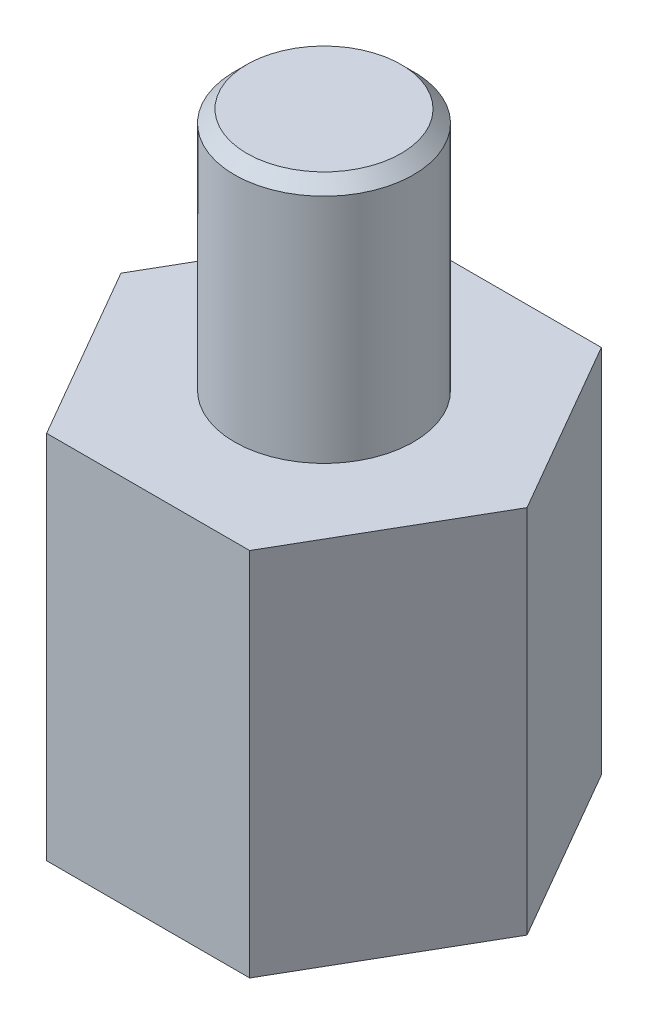
ISO-10303-21;
HEADER;
FILE_DESCRIPTION(('STEP AP214'),'2;1');
FILE_NAME('part.step','',(''),(''),'','','');
FILE_SCHEMA(('AUTOMOTIVE_DESIGN { 1 0 10303 214 1 1 1 1 }'));
ENDSEC;
DATA;
#1=APPLICATION_CONTEXT('core data for automotive mechanical design processes');
#2=APPLICATION_PROTOCOL_DEFINITION('international standard','automotive_design',2000,#1);
#3=PRODUCT_CONTEXT('',#1,'mechanical');
#4=PRODUCT('Part','Part','',(#3));
#5=PRODUCT_RELATED_PRODUCT_CATEGORY('part','',(#4));
#6=PRODUCT_DEFINITION_FORMATION('','',#4);
#7=PRODUCT_DEFINITION_CONTEXT('part definition',#1,'design');
#8=PRODUCT_DEFINITION('design','',#6,#7);
#9=PRODUCT_DEFINITION_SHAPE('','',#8);
#10=(LENGTH_UNIT() NAMED_UNIT(*) SI_UNIT(.MILLI.,.METRE.));
#11=(NAMED_UNIT(*) PLANE_ANGLE_UNIT() SI_UNIT($,.RADIAN.));
#12=(NAMED_UNIT(*) SI_UNIT($,.STERADIAN.) SOLID_ANGLE_UNIT());
#13=UNCERTAINTY_MEASURE_WITH_UNIT(LENGTH_MEASURE(1.E-05),#10,'distance_accuracy_value','');
#14=(GEOMETRIC_REPRESENTATION_CONTEXT(3) GLOBAL_UNCERTAINTY_ASSIGNED_CONTEXT((#13)) GLOBAL_UNIT_ASSIGNED_CONTEXT((#10,
#11,#12)) REPRESENTATION_CONTEXT('',''));
#15=CARTESIAN_POINT('',(0.,0.,0.));
#16=DIRECTION('',(0.,0.,1.));
#17=DIRECTION('',(1.,0.,0.));
#18=AXIS2_PLACEMENT_3D('',#15,#16,#17);
#19=CARTESIAN_POINT('',(0.,0.,0.));
#20=DIRECTION('',(0.,1.,0.));
#21=DIRECTION('',(0.,0.,1.));
#22=AXIS2_PLACEMENT_3D('',#19,#20,#21);
#23=PLANE('',#22);
#24=DIRECTION('',(1.,0.,0.));
#25=VECTOR('',#24,1.);
#26=CARTESIAN_POINT('',(-1.64544826719043,0.,2.85));
#27=LINE('',#26,#25);
#28=CARTESIAN_POINT('',(-1.64544826719043,0.,2.85));
#29=VERTEX_POINT('',#28);
#30=CARTESIAN_POINT('',(1.64544826719043,0.,2.85));
#31=VERTEX_POINT('',#30);
#32=EDGE_CURVE('E128',#29,#31,#27,.T.);
#33=ORIENTED_EDGE('',*,*,#32,.F.);
#34=DIRECTION('',(0.5,0.,0.866025403784438));
#35=VECTOR('',#34,1.);
#36=CARTESIAN_POINT('',(-3.29089653438087,0.,0.));
#37=LINE('',#36,#35);
#38=CARTESIAN_POINT('',(-3.29089653438087,0.,0.));
#39=VERTEX_POINT('',#38);
#40=EDGE_CURVE('E48',#39,#29,#37,.T.);
#41=ORIENTED_EDGE('',*,*,#40,.F.);
#42=DIRECTION('',(-0.5,0.,0.866025403784439));
#43=VECTOR('',#42,1.);
#44=CARTESIAN_POINT('',(-1.64544826719043,0.,-2.85));
#45=LINE('',#44,#43);
#46=CARTESIAN_POINT('',(-1.64544826719043,0.,-2.85));
#47=VERTEX_POINT('',#46);
#48=EDGE_CURVE('E56',#47,#39,#45,.T.);
#49=ORIENTED_EDGE('',*,*,#48,.F.);
#50=DIRECTION('',(-1.,0.,0.));
#51=VECTOR('',#50,1.);
#52=CARTESIAN_POINT('',(1.64544826719043,0.,-2.85));
#53=LINE('',#52,#51);
#54=CARTESIAN_POINT('',(1.64544826719043,0.,-2.85));
#55=VERTEX_POINT('',#54);
#56=EDGE_CURVE('E134',#55,#47,#53,.T.);
#57=ORIENTED_EDGE('',*,*,#56,.F.);
#58=DIRECTION('',(-0.5,0.,-0.866025403784439));
#59=VECTOR('',#58,1.);
#60=CARTESIAN_POINT('',(3.29089653438087,0.,0.));
#61=LINE('',#60,#59);
#62=CARTESIAN_POINT('',(3.29089653438087,0.,0.));
#63=VERTEX_POINT('',#62);
#64=EDGE_CURVE('E132',#63,#55,#61,.T.);
#65=ORIENTED_EDGE('',*,*,#64,.F.);
#66=DIRECTION('',(0.5,0.,-0.866025403784439));
#67=VECTOR('',#66,1.);
#68=CARTESIAN_POINT('',(1.64544826719043,0.,2.85));
#69=LINE('',#68,#67);
#70=EDGE_CURVE('E130',#31,#63,#69,.T.);
#71=ORIENTED_EDGE('',*,*,#70,.F.);
#72=EDGE_LOOP('',(#33,#41,#49,#57,#65,#71));
#73=FACE_BOUND('',#72,.T.);
#74=CARTESIAN_POINT('',(0.,0.,0.));
#75=DIRECTION('',(0.,1.,0.));
#76=DIRECTION('',(0.,0.,1.));
#77=AXIS2_PLACEMENT_3D('',#74,#75,#76);
#78=CIRCLE('',#77,1.4);
#79=CARTESIAN_POINT('',(0.,0.,1.4));
#80=VERTEX_POINT('',#79);
#81=EDGE_CURVE('E125',#80,#80,#78,.T.);
#82=ORIENTED_EDGE('',*,*,#81,.T.);
#83=EDGE_LOOP('',(#82));
#84=FACE_BOUND('',#83,.T.);
#85=ADVANCED_FACE('F33',(#73,#84),#23,.F.);
#86=CARTESIAN_POINT('',(-1.64544826719043,5.,2.85));
#87=DIRECTION('',(0.,0.,-1.));
#88=DIRECTION('',(-1.,0.,0.));
#89=AXIS2_PLACEMENT_3D('',#86,#87,#88);
#90=PLANE('',#89);
#91=ORIENTED_EDGE('',*,*,#32,.T.);
#92=DIRECTION('',(0.,-1.,0.));
#93=VECTOR('',#92,1.);
#94=CARTESIAN_POINT('',(1.64544826719043,5.,2.85));
#95=LINE('',#94,#93);
#96=CARTESIAN_POINT('',(1.64544826719043,6.,2.85));
#97=VERTEX_POINT('',#96);
#98=EDGE_CURVE('E99',#97,#31,#95,.T.);
#99=ORIENTED_EDGE('',*,*,#98,.F.);
#100=DIRECTION('',(1.,0.,0.));
#101=VECTOR('',#100,1.);
#102=CARTESIAN_POINT('',(-1.64544826719043,6.,2.85));
#103=LINE('',#102,#101);
#104=CARTESIAN_POINT('',(-1.64544826719043,6.,2.85));
#105=VERTEX_POINT('',#104);
#106=EDGE_CURVE('E96',#105,#97,#103,.T.);
#107=ORIENTED_EDGE('',*,*,#106,.F.);
#108=DIRECTION('',(0.,-1.,0.));
#109=VECTOR('',#108,1.);
#110=CARTESIAN_POINT('',(-1.64544826719043,5.,2.85));
#111=LINE('',#110,#109);
#112=EDGE_CURVE('E85',#105,#29,#111,.T.);
#113=ORIENTED_EDGE('',*,*,#112,.T.);
#114=EDGE_LOOP('',(#91,#99,#107,#113));
#115=FACE_BOUND('',#114,.T.);
#116=ADVANCED_FACE('F97',(#115),#90,.F.);
#117=CARTESIAN_POINT('',(1.64544826719043,5.,2.85));
#118=DIRECTION('',(-0.866025403784439,0.,-0.5));
#119=DIRECTION('',(-0.5,0.,0.866025403784439));
#120=AXIS2_PLACEMENT_3D('',#117,#118,#119);
#121=PLANE('',#120);
#122=ORIENTED_EDGE('',*,*,#70,.T.);
#123=DIRECTION('',(0.,-1.,0.));
#124=VECTOR('',#123,1.);
#125=CARTESIAN_POINT('',(3.29089653438087,5.,0.));
#126=LINE('',#125,#124);
#127=CARTESIAN_POINT('',(3.29089653438087,6.,0.));
#128=VERTEX_POINT('',#127);
#129=EDGE_CURVE('E144',#128,#63,#126,.T.);
#130=ORIENTED_EDGE('',*,*,#129,.F.);
#131=DIRECTION('',(0.5,0.,-0.866025403784439));
#132=VECTOR('',#131,1.);
#133=CARTESIAN_POINT('',(1.64544826719043,6.,2.85));
#134=LINE('',#133,#132);
#135=EDGE_CURVE('E103',#97,#128,#134,.T.);
#136=ORIENTED_EDGE('',*,*,#135,.F.);
#137=ORIENTED_EDGE('',*,*,#98,.T.);
#138=EDGE_LOOP('',(#122,#130,#136,#137));
#139=FACE_BOUND('',#138,.T.);
#140=ADVANCED_FACE('F166',(#139),#121,.F.);
#141=CARTESIAN_POINT('',(3.29089653438087,5.,0.));
#142=DIRECTION('',(-0.866025403784439,0.,0.5));
#143=DIRECTION('',(0.5,0.,0.866025403784439));
#144=AXIS2_PLACEMENT_3D('',#141,#142,#143);
#145=PLANE('',#144);
#146=ORIENTED_EDGE('',*,*,#64,.T.);
#147=DIRECTION('',(0.,-1.,0.));
#148=VECTOR('',#147,1.);
#149=CARTESIAN_POINT('',(1.64544826719043,5.,-2.85));
#150=LINE('',#149,#148);
#151=CARTESIAN_POINT('',(1.64544826719043,6.,-2.85));
#152=VERTEX_POINT('',#151);
#153=EDGE_CURVE('E141',#152,#55,#150,.T.);
#154=ORIENTED_EDGE('',*,*,#153,.F.);
#155=DIRECTION('',(-0.5,0.,-0.866025403784439));
#156=VECTOR('',#155,1.);
#157=CARTESIAN_POINT('',(3.29089653438087,6.,0.));
#158=LINE('',#157,#156);
#159=EDGE_CURVE('E116',#128,#152,#158,.T.);
#160=ORIENTED_EDGE('',*,*,#159,.F.);
#161=ORIENTED_EDGE('',*,*,#129,.T.);
#162=EDGE_LOOP('',(#146,#154,#160,#161));
#163=FACE_BOUND('',#162,.T.);
#164=ADVANCED_FACE('F180',(#163),#145,.F.);
#165=CARTESIAN_POINT('',(1.64544826719043,5.,-2.85));
#166=DIRECTION('',(0.,0.,1.));
#167=DIRECTION('',(1.,0.,0.));
#168=AXIS2_PLACEMENT_3D('',#165,#166,#167);
#169=PLANE('',#168);
#170=ORIENTED_EDGE('',*,*,#56,.T.);
#171=DIRECTION('',(0.,-1.,0.));
#172=VECTOR('',#171,1.);
#173=CARTESIAN_POINT('',(-1.64544826719043,5.,-2.85));
#174=LINE('',#173,#172);
#175=CARTESIAN_POINT('',(-1.64544826719043,6.,-2.85));
#176=VERTEX_POINT('',#175);
#177=EDGE_CURVE('E139',#176,#47,#174,.T.);
#178=ORIENTED_EDGE('',*,*,#177,.F.);
#179=DIRECTION('',(-1.,0.,0.));
#180=VECTOR('',#179,1.);
#181=CARTESIAN_POINT('',(1.64544826719043,6.,-2.85));
#182=LINE('',#181,#180);
#183=EDGE_CURVE('E119',#152,#176,#182,.T.);
#184=ORIENTED_EDGE('',*,*,#183,.F.);
#185=ORIENTED_EDGE('',*,*,#153,.T.);
#186=EDGE_LOOP('',(#170,#178,#184,#185));
#187=FACE_BOUND('',#186,.T.);
#188=ADVANCED_FACE('F177',(#187),#169,.F.);
#189=CARTESIAN_POINT('',(-1.64544826719043,5.,-2.85));
#190=DIRECTION('',(0.866025403784439,0.,0.5));
#191=DIRECTION('',(0.5,0.,-0.866025403784439));
#192=AXIS2_PLACEMENT_3D('',#189,#190,#191);
#193=PLANE('',#192);
#194=ORIENTED_EDGE('',*,*,#48,.T.);
#195=DIRECTION('',(0.,-1.,0.));
#196=VECTOR('',#195,1.);
#197=CARTESIAN_POINT('',(-3.29089653438087,5.,0.));
#198=LINE('',#197,#196);
#199=CARTESIAN_POINT('',(-3.29089653438087,6.,0.));
#200=VERTEX_POINT('',#199);
#201=EDGE_CURVE('E93',#200,#39,#198,.T.);
#202=ORIENTED_EDGE('',*,*,#201,.F.);
#203=DIRECTION('',(-0.5,0.,0.866025403784439));
#204=VECTOR('',#203,1.);
#205=CARTESIAN_POINT('',(-1.64544826719043,6.,-2.85));
#206=LINE('',#205,#204);
#207=EDGE_CURVE('E109',#176,#200,#206,.T.);
#208=ORIENTED_EDGE('',*,*,#207,.F.);
#209=ORIENTED_EDGE('',*,*,#177,.T.);
#210=EDGE_LOOP('',(#194,#202,#208,#209));
#211=FACE_BOUND('',#210,.T.);
#212=ADVANCED_FACE('F174',(#211),#193,.F.);
#213=CARTESIAN_POINT('',(-3.29089653438087,5.,0.));
#214=DIRECTION('',(0.866025403784439,0.,-0.5));
#215=DIRECTION('',(-0.5,0.,-0.866025403784439));
#216=AXIS2_PLACEMENT_3D('',#213,#214,#215);
#217=PLANE('',#216);
#218=ORIENTED_EDGE('',*,*,#40,.T.);
#219=ORIENTED_EDGE('',*,*,#112,.F.);
#220=DIRECTION('',(0.5,0.,0.866025403784438));
#221=VECTOR('',#220,1.);
#222=CARTESIAN_POINT('',(-3.29089653438087,6.,0.));
#223=LINE('',#222,#221);
#224=EDGE_CURVE('E89',#200,#105,#223,.T.);
#225=ORIENTED_EDGE('',*,*,#224,.F.);
#226=ORIENTED_EDGE('',*,*,#201,.T.);
#227=EDGE_LOOP('',(#218,#219,#225,#226));
#228=FACE_BOUND('',#227,.T.);
#229=ADVANCED_FACE('F87',(#228),#217,.F.);
#230=CARTESIAN_POINT('',(0.,5.,0.));
#231=DIRECTION('',(0.,-1.,0.));
#232=DIRECTION('',(0.,0.,-1.));
#233=AXIS2_PLACEMENT_3D('',#230,#231,#232);
#234=CYLINDRICAL_SURFACE('',#233,1.4);
#235=CARTESIAN_POINT('',(0.,5.,0.));
#236=DIRECTION('',(0.,1.,0.));
#237=DIRECTION('',(0.,0.,1.));
#238=AXIS2_PLACEMENT_3D('',#235,#236,#237);
#239=CIRCLE('',#238,1.4);
#240=CARTESIAN_POINT('',(0.,5.,1.4));
#241=VERTEX_POINT('',#240);
#242=EDGE_CURVE('E122',#241,#241,#239,.T.);
#243=ORIENTED_EDGE('',*,*,#242,.T.);
#244=EDGE_LOOP('',(#243));
#245=FACE_BOUND('',#244,.T.);
#246=ORIENTED_EDGE('',*,*,#81,.F.);
#247=EDGE_LOOP('',(#246));
#248=FACE_BOUND('',#247,.T.);
#249=ADVANCED_FACE('F170',(#245,#248),#234,.F.);
#250=CARTESIAN_POINT('',(0.,5.,0.));
#251=DIRECTION('',(0.,1.,0.));
#252=DIRECTION('',(0.,0.,1.));
#253=AXIS2_PLACEMENT_3D('',#250,#251,#252);
#254=PLANE('',#253);
#255=ORIENTED_EDGE('',*,*,#242,.F.);
#256=EDGE_LOOP('',(#255));
#257=FACE_BOUND('',#256,.T.);
#258=ADVANCED_FACE('F218',(#257),#254,.F.);
#259=CARTESIAN_POINT('',(0.,6.,0.));
#260=DIRECTION('',(0.,1.,0.));
#261=DIRECTION('',(0.,0.,1.));
#262=AXIS2_PLACEMENT_3D('',#259,#260,#261);
#263=PLANE('',#262);
#264=CARTESIAN_POINT('',(0.,6.,0.));
#265=DIRECTION('',(0.,1.,0.));
#266=DIRECTION('',(0.,0.,1.));
#267=AXIS2_PLACEMENT_3D('',#264,#265,#266);
#268=CIRCLE('',#267,1.45);
#269=CARTESIAN_POINT('',(0.,6.,1.45));
#270=VERTEX_POINT('',#269);
#271=EDGE_CURVE('E110',#270,#270,#268,.T.);
#272=ORIENTED_EDGE('',*,*,#271,.F.);
#273=EDGE_LOOP('',(#272));
#274=FACE_BOUND('',#273,.T.);
#275=ORIENTED_EDGE('',*,*,#224,.T.);
#276=ORIENTED_EDGE('',*,*,#106,.T.);
#277=ORIENTED_EDGE('',*,*,#135,.T.);
#278=ORIENTED_EDGE('',*,*,#159,.T.);
#279=ORIENTED_EDGE('',*,*,#183,.T.);
#280=ORIENTED_EDGE('',*,*,#207,.T.);
#281=EDGE_LOOP('',(#275,#276,#277,#278,#279,#280));
#282=FACE_BOUND('',#281,.T.);
#283=ADVANCED_FACE('F106',(#274,#282),#263,.T.);
#284=CARTESIAN_POINT('',(0.,9.95,0.));
#285=DIRECTION('',(0.,-1.,0.));
#286=DIRECTION('',(0.,0.,-1.));
#287=AXIS2_PLACEMENT_3D('',#284,#285,#286);
#288=CYLINDRICAL_SURFACE('',#287,1.45);
#289=CARTESIAN_POINT('',(0.,9.75,0.));
#290=DIRECTION('',(0.,1.,0.));
#291=DIRECTION('',(0.,0.,1.));
#292=AXIS2_PLACEMENT_3D('',#289,#290,#291);
#293=CIRCLE('',#292,1.45);
#294=CARTESIAN_POINT('',(0.,9.75,1.45));
#295=VERTEX_POINT('',#294);
#296=EDGE_CURVE('E11',#295,#295,#293,.F.);
#297=ORIENTED_EDGE('',*,*,#296,.T.);
#298=EDGE_LOOP('',(#297));
#299=FACE_BOUND('',#298,.T.);
#300=ORIENTED_EDGE('',*,*,#271,.T.);
#301=EDGE_LOOP('',(#300));
#302=FACE_BOUND('',#301,.T.);
#303=ADVANCED_FACE('F157',(#299,#302),#288,.T.);
#304=CARTESIAN_POINT('',(0.,9.95,0.));
#305=DIRECTION('',(0.,1.,0.));
#306=DIRECTION('',(0.,0.,1.));
#307=AXIS2_PLACEMENT_3D('',#304,#305,#306);
#308=PLANE('',#307);
#309=CARTESIAN_POINT('',(0.,9.95,0.));
#310=DIRECTION('',(0.,1.,0.));
#311=DIRECTION('',(0.,0.,1.));
#312=AXIS2_PLACEMENT_3D('',#309,#310,#311);
#313=CIRCLE('',#312,1.25);
#314=CARTESIAN_POINT('',(0.,9.95,1.25));
#315=VERTEX_POINT('',#314);
#316=EDGE_CURVE('E41',#315,#315,#313,.T.);
#317=ORIENTED_EDGE('',*,*,#316,.T.);
#318=EDGE_LOOP('',(#317));
#319=FACE_BOUND('',#318,.T.);
#320=ADVANCED_FACE('F150',(#319),#308,.T.);
#321=CARTESIAN_POINT('',(0.,9.95,0.));
#322=DIRECTION('',(0.,-1.,0.));
#323=DIRECTION('',(0.,0.,-1.));
#324=AXIS2_PLACEMENT_3D('',#321,#322,#323);
#325=CONICAL_SURFACE('',#324,1.25,0.785398163397448);
#326=ORIENTED_EDGE('',*,*,#296,.F.);
#327=EDGE_LOOP('',(#326));
#328=FACE_BOUND('',#327,.T.);
#329=ORIENTED_EDGE('',*,*,#316,.F.);
#330=EDGE_LOOP('',(#329));
#331=FACE_BOUND('',#330,.T.);
#332=ADVANCED_FACE('F35',(#328,#331),#325,.T.);
#333=CLOSED_SHELL('',(#85,#116,#140,#164,#188,#212,#229,#249,#258,#283,#303,#320,#332));
#334=MANIFOLD_SOLID_BREP('B2',#333);
#335=ADVANCED_BREP_SHAPE_REPRESENTATION('',(#18,#334),#14);
#336=SHAPE_DEFINITION_REPRESENTATION(#9,#335);
ENDSEC;
END-ISO-10303-21;
